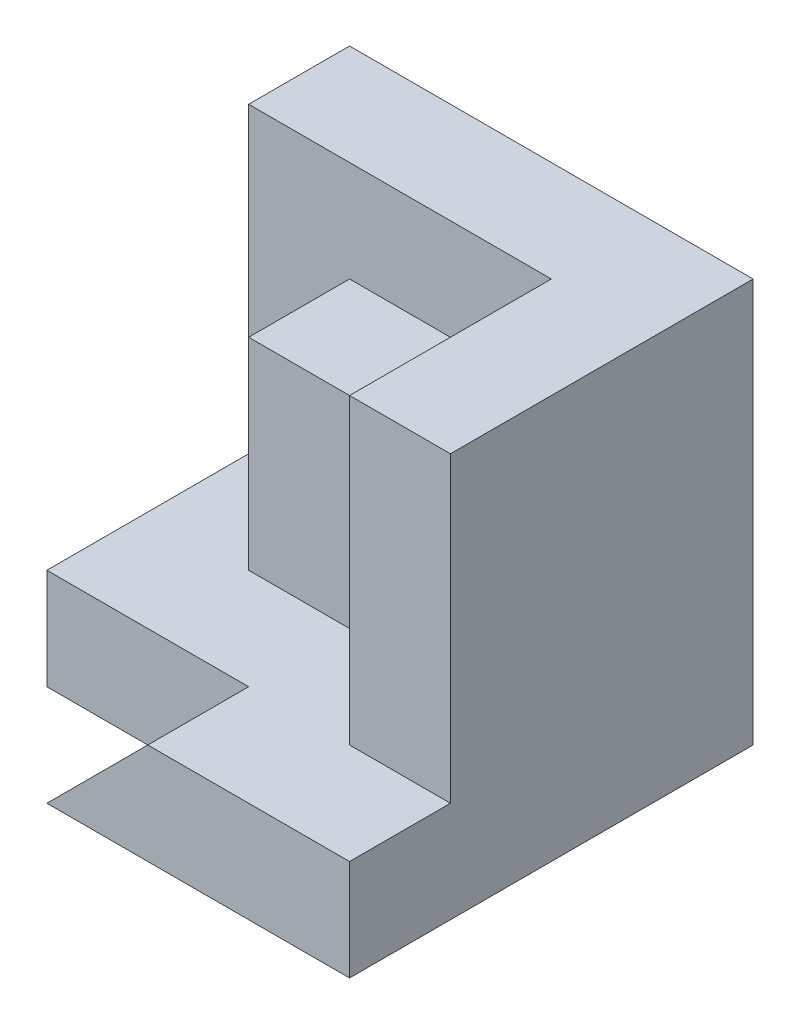
ISO-10303-21;
HEADER;
FILE_DESCRIPTION(('STEP AP214'),'2;1');
FILE_NAME('part.step','',(''),(''),'','','');
FILE_SCHEMA(('AUTOMOTIVE_DESIGN { 1 0 10303 214 1 1 1 1 }'));
ENDSEC;
DATA;
#1=APPLICATION_CONTEXT('core data for automotive mechanical design processes');
#2=APPLICATION_PROTOCOL_DEFINITION('international standard','automotive_design',2000,#1);
#3=PRODUCT_CONTEXT('',#1,'mechanical');
#4=PRODUCT('Part','Part','',(#3));
#5=PRODUCT_RELATED_PRODUCT_CATEGORY('part','',(#4));
#6=PRODUCT_DEFINITION_FORMATION('','',#4);
#7=PRODUCT_DEFINITION_CONTEXT('part definition',#1,'design');
#8=PRODUCT_DEFINITION('design','',#6,#7);
#9=PRODUCT_DEFINITION_SHAPE('','',#8);
#10=(LENGTH_UNIT() NAMED_UNIT(*) SI_UNIT(.MILLI.,.METRE.));
#11=(NAMED_UNIT(*) PLANE_ANGLE_UNIT() SI_UNIT($,.RADIAN.));
#12=(NAMED_UNIT(*) SI_UNIT($,.STERADIAN.) SOLID_ANGLE_UNIT());
#13=UNCERTAINTY_MEASURE_WITH_UNIT(LENGTH_MEASURE(1.E-05),#10,'distance_accuracy_value','');
#14=(GEOMETRIC_REPRESENTATION_CONTEXT(3) GLOBAL_UNCERTAINTY_ASSIGNED_CONTEXT((#13)) GLOBAL_UNIT_ASSIGNED_CONTEXT((#10,
#11,#12)) REPRESENTATION_CONTEXT('',''));
#15=CARTESIAN_POINT('',(0.,0.,0.));
#16=DIRECTION('',(0.,0.,1.));
#17=DIRECTION('',(1.,0.,0.));
#18=AXIS2_PLACEMENT_3D('',#15,#16,#17);
#19=CARTESIAN_POINT('',(0.,0.,30.));
#20=DIRECTION('',(0.,0.,-1.));
#21=DIRECTION('',(-1.,0.,0.));
#22=AXIS2_PLACEMENT_3D('',#19,#20,#21);
#23=PLANE('',#22);
#24=DIRECTION('',(1.,0.,0.));
#25=VECTOR('',#24,1.);
#26=CARTESIAN_POINT('',(0.,10.,30.));
#27=LINE('',#26,#25);
#28=CARTESIAN_POINT('',(0.,10.,30.));
#29=VERTEX_POINT('',#28);
#30=CARTESIAN_POINT('',(20.,10.,30.));
#31=VERTEX_POINT('',#30);
#32=EDGE_CURVE('E48',#29,#31,#27,.T.);
#33=ORIENTED_EDGE('',*,*,#32,.F.);
#34=DIRECTION('',(0.,1.,0.));
#35=VECTOR('',#34,1.);
#36=CARTESIAN_POINT('',(0.,0.,30.));
#37=LINE('',#36,#35);
#38=CARTESIAN_POINT('',(0.,0.,30.));
#39=VERTEX_POINT('',#38);
#40=EDGE_CURVE('E116',#39,#29,#37,.T.);
#41=ORIENTED_EDGE('',*,*,#40,.F.);
#42=DIRECTION('',(-1.,0.,0.));
#43=VECTOR('',#42,1.);
#44=CARTESIAN_POINT('',(0.,0.,30.));
#45=LINE('',#44,#43);
#46=CARTESIAN_POINT('',(10.,0.,30.));
#47=VERTEX_POINT('',#46);
#48=EDGE_CURVE('E235',#47,#39,#45,.T.);
#49=ORIENTED_EDGE('',*,*,#48,.F.);
#50=DIRECTION('',(0.707106781186546,0.707106781186549,0.));
#51=VECTOR('',#50,1.);
#52=CARTESIAN_POINT('',(10.,0.,30.));
#53=LINE('',#52,#51);
#54=EDGE_CURVE('E217',#47,#31,#53,.T.);
#55=ORIENTED_EDGE('',*,*,#54,.T.);
#56=EDGE_LOOP('',(#33,#41,#49,#55));
#57=FACE_BOUND('',#56,.T.);
#58=ADVANCED_FACE('F33',(#57),#23,.F.);
#59=CARTESIAN_POINT('',(0.,0.,40.));
#60=DIRECTION('',(1.,0.,0.));
#61=DIRECTION('',(0.,0.,-1.));
#62=AXIS2_PLACEMENT_3D('',#59,#60,#61);
#63=PLANE('',#62);
#64=DIRECTION('',(0.,0.,1.));
#65=VECTOR('',#64,1.);
#66=CARTESIAN_POINT('',(0.,10.,0.));
#67=LINE('',#66,#65);
#68=CARTESIAN_POINT('',(0.,10.,10.));
#69=VERTEX_POINT('',#68);
#70=EDGE_CURVE('E380',#69,#29,#67,.T.);
#71=ORIENTED_EDGE('',*,*,#70,.F.);
#72=DIRECTION('',(0.,1.,0.));
#73=VECTOR('',#72,1.);
#74=CARTESIAN_POINT('',(0.,10.,10.));
#75=LINE('',#74,#73);
#76=CARTESIAN_POINT('',(0.,40.,10.));
#77=VERTEX_POINT('',#76);
#78=EDGE_CURVE('E207',#69,#77,#75,.T.);
#79=ORIENTED_EDGE('',*,*,#78,.T.);
#80=DIRECTION('',(0.,0.,-1.));
#81=VECTOR('',#80,1.);
#82=CARTESIAN_POINT('',(0.,40.,40.));
#83=LINE('',#82,#81);
#84=CARTESIAN_POINT('',(0.,40.,0.));
#85=VERTEX_POINT('',#84);
#86=EDGE_CURVE('E90',#77,#85,#83,.T.);
#87=ORIENTED_EDGE('',*,*,#86,.T.);
#88=DIRECTION('',(0.,-1.,0.));
#89=VECTOR('',#88,1.);
#90=CARTESIAN_POINT('',(0.,0.,0.));
#91=LINE('',#90,#89);
#92=CARTESIAN_POINT('',(0.,0.,0.));
#93=VERTEX_POINT('',#92);
#94=EDGE_CURVE('E103',#85,#93,#91,.T.);
#95=ORIENTED_EDGE('',*,*,#94,.T.);
#96=DIRECTION('',(0.,0.,-1.));
#97=VECTOR('',#96,1.);
#98=CARTESIAN_POINT('',(0.,0.,40.));
#99=LINE('',#98,#97);
#100=EDGE_CURVE('E11',#39,#93,#99,.T.);
#101=ORIENTED_EDGE('',*,*,#100,.F.);
#102=ORIENTED_EDGE('',*,*,#40,.T.);
#103=EDGE_LOOP('',(#71,#79,#87,#95,#101,#102));
#104=FACE_BOUND('',#103,.T.);
#105=ADVANCED_FACE('F35',(#104),#63,.F.);
#106=CARTESIAN_POINT('',(0.,0.,40.));
#107=DIRECTION('',(0.,1.,0.));
#108=DIRECTION('',(0.,0.,1.));
#109=AXIS2_PLACEMENT_3D('',#106,#107,#108);
#110=PLANE('',#109);
#111=DIRECTION('',(0.,0.,-1.));
#112=VECTOR('',#111,1.);
#113=CARTESIAN_POINT('',(10.,0.,40.));
#114=LINE('',#113,#112);
#115=CARTESIAN_POINT('',(10.,0.,40.));
#116=VERTEX_POINT('',#115);
#117=EDGE_CURVE('E233',#116,#47,#114,.T.);
#118=ORIENTED_EDGE('',*,*,#117,.T.);
#119=ORIENTED_EDGE('',*,*,#48,.T.);
#120=ORIENTED_EDGE('',*,*,#100,.T.);
#121=DIRECTION('',(1.,0.,0.));
#122=VECTOR('',#121,1.);
#123=CARTESIAN_POINT('',(0.,0.,0.));
#124=LINE('',#123,#122);
#125=CARTESIAN_POINT('',(40.,0.,0.));
#126=VERTEX_POINT('',#125);
#127=EDGE_CURVE('E99',#93,#126,#124,.T.);
#128=ORIENTED_EDGE('',*,*,#127,.T.);
#129=DIRECTION('',(0.,0.,-1.));
#130=VECTOR('',#129,1.);
#131=CARTESIAN_POINT('',(40.,0.,40.));
#132=LINE('',#131,#130);
#133=CARTESIAN_POINT('',(40.,0.,40.));
#134=VERTEX_POINT('',#133);
#135=EDGE_CURVE('E41',#134,#126,#132,.T.);
#136=ORIENTED_EDGE('',*,*,#135,.F.);
#137=DIRECTION('',(1.,0.,0.));
#138=VECTOR('',#137,1.);
#139=CARTESIAN_POINT('',(0.,0.,40.));
#140=LINE('',#139,#138);
#141=EDGE_CURVE('E57',#116,#134,#140,.T.);
#142=ORIENTED_EDGE('',*,*,#141,.F.);
#143=EDGE_LOOP('',(#118,#119,#120,#128,#136,#142));
#144=FACE_BOUND('',#143,.T.);
#145=ADVANCED_FACE('F119',(#144),#110,.F.);
#146=CARTESIAN_POINT('',(40.,0.,40.));
#147=DIRECTION('',(-1.,0.,0.));
#148=DIRECTION('',(0.,0.,1.));
#149=AXIS2_PLACEMENT_3D('',#146,#147,#148);
#150=PLANE('',#149);
#151=DIRECTION('',(0.,0.,-1.));
#152=VECTOR('',#151,1.);
#153=CARTESIAN_POINT('',(40.,40.,40.));
#154=LINE('',#153,#152);
#155=CARTESIAN_POINT('',(40.,40.,30.));
#156=VERTEX_POINT('',#155);
#157=CARTESIAN_POINT('',(40.,40.,0.));
#158=VERTEX_POINT('',#157);
#159=EDGE_CURVE('E75',#156,#158,#154,.T.);
#160=ORIENTED_EDGE('',*,*,#159,.F.);
#161=DIRECTION('',(0.,-1.,0.));
#162=VECTOR('',#161,1.);
#163=CARTESIAN_POINT('',(40.,0.,30.));
#164=LINE('',#163,#162);
#165=CARTESIAN_POINT('',(40.,10.,30.));
#166=VERTEX_POINT('',#165);
#167=EDGE_CURVE('E231',#156,#166,#164,.T.);
#168=ORIENTED_EDGE('',*,*,#167,.T.);
#169=DIRECTION('',(0.,0.,1.));
#170=VECTOR('',#169,1.);
#171=CARTESIAN_POINT('',(40.,10.,40.));
#172=LINE('',#171,#170);
#173=CARTESIAN_POINT('',(40.,10.,40.));
#174=VERTEX_POINT('',#173);
#175=EDGE_CURVE('E226',#166,#174,#172,.T.);
#176=ORIENTED_EDGE('',*,*,#175,.T.);
#177=DIRECTION('',(0.,1.,0.));
#178=VECTOR('',#177,1.);
#179=CARTESIAN_POINT('',(40.,0.,40.));
#180=LINE('',#179,#178);
#181=EDGE_CURVE('E105',#134,#174,#180,.T.);
#182=ORIENTED_EDGE('',*,*,#181,.F.);
#183=ORIENTED_EDGE('',*,*,#135,.T.);
#184=DIRECTION('',(0.,1.,0.));
#185=VECTOR('',#184,1.);
#186=CARTESIAN_POINT('',(40.,0.,0.));
#187=LINE('',#186,#185);
#188=EDGE_CURVE('E94',#126,#158,#187,.T.);
#189=ORIENTED_EDGE('',*,*,#188,.T.);
#190=EDGE_LOOP('',(#160,#168,#176,#182,#183,#189));
#191=FACE_BOUND('',#190,.T.);
#192=ADVANCED_FACE('F95',(#191),#150,.F.);
#193=CARTESIAN_POINT('',(0.,40.,40.));
#194=DIRECTION('',(0.,-1.,0.));
#195=DIRECTION('',(0.,0.,-1.));
#196=AXIS2_PLACEMENT_3D('',#193,#194,#195);
#197=PLANE('',#196);
#198=DIRECTION('',(-1.,0.,0.));
#199=VECTOR('',#198,1.);
#200=CARTESIAN_POINT('',(0.,40.,10.));
#201=LINE('',#200,#199);
#202=CARTESIAN_POINT('',(30.,40.,10.));
#203=VERTEX_POINT('',#202);
#204=EDGE_CURVE('E371',#203,#77,#201,.T.);
#205=ORIENTED_EDGE('',*,*,#204,.F.);
#206=DIRECTION('',(0.,0.,-1.));
#207=VECTOR('',#206,1.);
#208=CARTESIAN_POINT('',(30.,40.,0.));
#209=LINE('',#208,#207);
#210=CARTESIAN_POINT('',(30.,40.,30.));
#211=VERTEX_POINT('',#210);
#212=EDGE_CURVE('E369',#211,#203,#209,.T.);
#213=ORIENTED_EDGE('',*,*,#212,.F.);
#214=DIRECTION('',(-1.,0.,0.));
#215=VECTOR('',#214,1.);
#216=CARTESIAN_POINT('',(0.,40.,30.));
#217=LINE('',#216,#215);
#218=EDGE_CURVE('E86',#156,#211,#217,.T.);
#219=ORIENTED_EDGE('',*,*,#218,.F.);
#220=ORIENTED_EDGE('',*,*,#159,.T.);
#221=DIRECTION('',(-1.,0.,0.));
#222=VECTOR('',#221,1.);
#223=CARTESIAN_POINT('',(0.,40.,0.));
#224=LINE('',#223,#222);
#225=EDGE_CURVE('E81',#158,#85,#224,.T.);
#226=ORIENTED_EDGE('',*,*,#225,.T.);
#227=ORIENTED_EDGE('',*,*,#86,.F.);
#228=EDGE_LOOP('',(#205,#213,#219,#220,#226,#227));
#229=FACE_BOUND('',#228,.T.);
#230=ADVANCED_FACE('F78',(#229),#197,.F.);
#231=CARTESIAN_POINT('',(0.,0.,40.));
#232=DIRECTION('',(0.,0.,-1.));
#233=DIRECTION('',(-1.,0.,0.));
#234=AXIS2_PLACEMENT_3D('',#231,#232,#233);
#235=PLANE('',#234);
#236=DIRECTION('',(-1.,0.,0.));
#237=VECTOR('',#236,1.);
#238=CARTESIAN_POINT('',(50.,10.,40.));
#239=LINE('',#238,#237);
#240=CARTESIAN_POINT('',(20.,10.,40.));
#241=VERTEX_POINT('',#240);
#242=EDGE_CURVE('E224',#174,#241,#239,.T.);
#243=ORIENTED_EDGE('',*,*,#242,.T.);
#244=DIRECTION('',(0.707106781186546,0.707106781186549,0.));
#245=VECTOR('',#244,1.);
#246=CARTESIAN_POINT('',(10.,0.,40.));
#247=LINE('',#246,#245);
#248=EDGE_CURVE('E220',#116,#241,#247,.T.);
#249=ORIENTED_EDGE('',*,*,#248,.F.);
#250=ORIENTED_EDGE('',*,*,#141,.T.);
#251=ORIENTED_EDGE('',*,*,#181,.T.);
#252=EDGE_LOOP('',(#243,#249,#250,#251));
#253=FACE_BOUND('',#252,.T.);
#254=ADVANCED_FACE('F244',(#253),#235,.F.);
#255=CARTESIAN_POINT('',(0.,0.,0.));
#256=DIRECTION('',(0.,0.,-1.));
#257=DIRECTION('',(-1.,0.,0.));
#258=AXIS2_PLACEMENT_3D('',#255,#256,#257);
#259=PLANE('',#258);
#260=ORIENTED_EDGE('',*,*,#94,.F.);
#261=ORIENTED_EDGE('',*,*,#225,.F.);
#262=ORIENTED_EDGE('',*,*,#188,.F.);
#263=ORIENTED_EDGE('',*,*,#127,.F.);
#264=EDGE_LOOP('',(#260,#261,#262,#263));
#265=FACE_BOUND('',#264,.T.);
#266=ADVANCED_FACE('F101',(#265),#259,.T.);
#267=ORIENTED_EDGE('',*,*,#218,.T.);
#268=DIRECTION('',(0.,1.,0.));
#269=VECTOR('',#268,1.);
#270=CARTESIAN_POINT('',(30.,10.,30.));
#271=LINE('',#270,#269);
#272=CARTESIAN_POINT('',(30.,10.,30.));
#273=VERTEX_POINT('',#272);
#274=EDGE_CURVE('E210',#273,#211,#271,.T.);
#275=ORIENTED_EDGE('',*,*,#274,.F.);
#276=DIRECTION('',(-1.,0.,0.));
#277=VECTOR('',#276,1.);
#278=CARTESIAN_POINT('',(50.,10.,30.));
#279=LINE('',#278,#277);
#280=EDGE_CURVE('E223',#166,#273,#279,.T.);
#281=ORIENTED_EDGE('',*,*,#280,.F.);
#282=ORIENTED_EDGE('',*,*,#167,.F.);
#283=EDGE_LOOP('',(#267,#275,#281,#282));
#284=FACE_BOUND('',#283,.T.);
#285=ADVANCED_FACE('F239',(#284),#23,.F.);
#286=CARTESIAN_POINT('',(50.,10.,0.));
#287=DIRECTION('',(0.,-1.,0.));
#288=DIRECTION('',(0.,0.,-1.));
#289=AXIS2_PLACEMENT_3D('',#286,#287,#288);
#290=PLANE('',#289);
#291=ORIENTED_EDGE('',*,*,#280,.T.);
#292=DIRECTION('',(0.,0.,-1.));
#293=VECTOR('',#292,1.);
#294=CARTESIAN_POINT('',(30.,10.,0.));
#295=LINE('',#294,#293);
#296=CARTESIAN_POINT('',(30.,10.,20.));
#297=VERTEX_POINT('',#296);
#298=EDGE_CURVE('E213',#273,#297,#295,.T.);
#299=ORIENTED_EDGE('',*,*,#298,.T.);
#300=DIRECTION('',(-1.,0.,0.));
#301=VECTOR('',#300,1.);
#302=CARTESIAN_POINT('',(0.,10.,20.));
#303=LINE('',#302,#301);
#304=CARTESIAN_POINT('',(10.,10.,20.));
#305=VERTEX_POINT('',#304);
#306=EDGE_CURVE('E208',#297,#305,#303,.T.);
#307=ORIENTED_EDGE('',*,*,#306,.T.);
#308=DIRECTION('',(0.,0.,-1.));
#309=VECTOR('',#308,1.);
#310=CARTESIAN_POINT('',(10.,10.,0.));
#311=LINE('',#310,#309);
#312=CARTESIAN_POINT('',(10.,10.,10.));
#313=VERTEX_POINT('',#312);
#314=EDGE_CURVE('E370',#305,#313,#311,.T.);
#315=ORIENTED_EDGE('',*,*,#314,.T.);
#316=DIRECTION('',(-1.,0.,0.));
#317=VECTOR('',#316,1.);
#318=CARTESIAN_POINT('',(0.,10.,10.));
#319=LINE('',#318,#317);
#320=EDGE_CURVE('E205',#313,#69,#319,.T.);
#321=ORIENTED_EDGE('',*,*,#320,.T.);
#322=ORIENTED_EDGE('',*,*,#70,.T.);
#323=ORIENTED_EDGE('',*,*,#32,.T.);
#324=DIRECTION('',(0.,0.,1.));
#325=VECTOR('',#324,1.);
#326=CARTESIAN_POINT('',(20.,10.,30.));
#327=LINE('',#326,#325);
#328=EDGE_CURVE('E219',#31,#241,#327,.T.);
#329=ORIENTED_EDGE('',*,*,#328,.T.);
#330=ORIENTED_EDGE('',*,*,#242,.F.);
#331=ORIENTED_EDGE('',*,*,#175,.F.);
#332=EDGE_LOOP('',(#291,#299,#307,#315,#321,#322,#323,#329,#330,#331));
#333=FACE_BOUND('',#332,.T.);
#334=ADVANCED_FACE('F241',(#333),#290,.F.);
#335=CARTESIAN_POINT('',(10.,0.,30.));
#336=DIRECTION('',(0.707106781186549,-0.707106781186546,0.));
#337=DIRECTION('',(0.707106781186546,0.707106781186549,0.));
#338=AXIS2_PLACEMENT_3D('',#335,#336,#337);
#339=PLANE('',#338);
#340=ORIENTED_EDGE('',*,*,#248,.T.);
#341=ORIENTED_EDGE('',*,*,#328,.F.);
#342=ORIENTED_EDGE('',*,*,#54,.F.);
#343=ORIENTED_EDGE('',*,*,#117,.F.);
#344=EDGE_LOOP('',(#340,#341,#342,#343));
#345=FACE_BOUND('',#344,.T.);
#346=ADVANCED_FACE('F246',(#345),#339,.F.);
#347=CARTESIAN_POINT('',(10.,10.,0.));
#348=DIRECTION('',(1.,0.,0.));
#349=DIRECTION('',(0.,0.,-1.));
#350=AXIS2_PLACEMENT_3D('',#347,#348,#349);
#351=PLANE('',#350);
#352=DIRECTION('',(0.,1.,0.));
#353=VECTOR('',#352,1.);
#354=CARTESIAN_POINT('',(10.,10.,20.));
#355=LINE('',#354,#353);
#356=CARTESIAN_POINT('',(10.,30.,20.));
#357=VERTEX_POINT('',#356);
#358=EDGE_CURVE('E201',#305,#357,#355,.T.);
#359=ORIENTED_EDGE('',*,*,#358,.T.);
#360=DIRECTION('',(0.,0.,1.));
#361=VECTOR('',#360,1.);
#362=CARTESIAN_POINT('',(10.,30.,10.));
#363=LINE('',#362,#361);
#364=CARTESIAN_POINT('',(10.,30.,10.));
#365=VERTEX_POINT('',#364);
#366=EDGE_CURVE('E185',#365,#357,#363,.T.);
#367=ORIENTED_EDGE('',*,*,#366,.F.);
#368=DIRECTION('',(0.,1.,0.));
#369=VECTOR('',#368,1.);
#370=CARTESIAN_POINT('',(10.,10.,10.));
#371=LINE('',#370,#369);
#372=EDGE_CURVE('E199',#313,#365,#371,.T.);
#373=ORIENTED_EDGE('',*,*,#372,.F.);
#374=ORIENTED_EDGE('',*,*,#314,.F.);
#375=EDGE_LOOP('',(#359,#367,#373,#374));
#376=FACE_BOUND('',#375,.T.);
#377=ADVANCED_FACE('F197',(#376),#351,.F.);
#378=CARTESIAN_POINT('',(0.,10.,20.));
#379=DIRECTION('',(0.,0.,-1.));
#380=DIRECTION('',(-1.,0.,0.));
#381=AXIS2_PLACEMENT_3D('',#378,#379,#380);
#382=PLANE('',#381);
#383=DIRECTION('',(0.,1.,0.));
#384=VECTOR('',#383,1.);
#385=CARTESIAN_POINT('',(30.,10.,20.));
#386=LINE('',#385,#384);
#387=CARTESIAN_POINT('',(30.,30.,20.));
#388=VERTEX_POINT('',#387);
#389=EDGE_CURVE('E385',#297,#388,#386,.T.);
#390=ORIENTED_EDGE('',*,*,#389,.T.);
#391=DIRECTION('',(1.,0.,0.));
#392=VECTOR('',#391,1.);
#393=CARTESIAN_POINT('',(10.,30.,20.));
#394=LINE('',#393,#392);
#395=EDGE_CURVE('E193',#357,#388,#394,.T.);
#396=ORIENTED_EDGE('',*,*,#395,.F.);
#397=ORIENTED_EDGE('',*,*,#358,.F.);
#398=ORIENTED_EDGE('',*,*,#306,.F.);
#399=EDGE_LOOP('',(#390,#396,#397,#398));
#400=FACE_BOUND('',#399,.T.);
#401=ADVANCED_FACE('F324',(#400),#382,.F.);
#402=CARTESIAN_POINT('',(30.,10.,0.));
#403=DIRECTION('',(1.,0.,0.));
#404=DIRECTION('',(0.,0.,-1.));
#405=AXIS2_PLACEMENT_3D('',#402,#403,#404);
#406=PLANE('',#405);
#407=ORIENTED_EDGE('',*,*,#212,.T.);
#408=DIRECTION('',(0.,1.,0.));
#409=VECTOR('',#408,1.);
#410=CARTESIAN_POINT('',(30.,40.,10.));
#411=LINE('',#410,#409);
#412=CARTESIAN_POINT('',(30.,30.,10.));
#413=VERTEX_POINT('',#412);
#414=EDGE_CURVE('E192',#413,#203,#411,.T.);
#415=ORIENTED_EDGE('',*,*,#414,.F.);
#416=DIRECTION('',(0.,0.,1.));
#417=VECTOR('',#416,1.);
#418=CARTESIAN_POINT('',(30.,30.,10.));
#419=LINE('',#418,#417);
#420=EDGE_CURVE('E187',#413,#388,#419,.T.);
#421=ORIENTED_EDGE('',*,*,#420,.T.);
#422=ORIENTED_EDGE('',*,*,#389,.F.);
#423=ORIENTED_EDGE('',*,*,#298,.F.);
#424=ORIENTED_EDGE('',*,*,#274,.T.);
#425=EDGE_LOOP('',(#407,#415,#421,#422,#423,#424));
#426=FACE_BOUND('',#425,.T.);
#427=ADVANCED_FACE('F330',(#426),#406,.F.);
#428=CARTESIAN_POINT('',(0.,10.,10.));
#429=DIRECTION('',(0.,0.,-1.));
#430=DIRECTION('',(-1.,0.,0.));
#431=AXIS2_PLACEMENT_3D('',#428,#429,#430);
#432=PLANE('',#431);
#433=ORIENTED_EDGE('',*,*,#204,.T.);
#434=ORIENTED_EDGE('',*,*,#78,.F.);
#435=ORIENTED_EDGE('',*,*,#320,.F.);
#436=ORIENTED_EDGE('',*,*,#372,.T.);
#437=DIRECTION('',(1.,0.,0.));
#438=VECTOR('',#437,1.);
#439=CARTESIAN_POINT('',(10.,30.,10.));
#440=LINE('',#439,#438);
#441=EDGE_CURVE('E181',#365,#413,#440,.T.);
#442=ORIENTED_EDGE('',*,*,#441,.T.);
#443=ORIENTED_EDGE('',*,*,#414,.T.);
#444=EDGE_LOOP('',(#433,#434,#435,#436,#442,#443));
#445=FACE_BOUND('',#444,.T.);
#446=ADVANCED_FACE('F203',(#445),#432,.F.);
#447=CARTESIAN_POINT('',(10.,30.,10.));
#448=DIRECTION('',(0.,-1.,0.));
#449=DIRECTION('',(0.,0.,-1.));
#450=AXIS2_PLACEMENT_3D('',#447,#448,#449);
#451=PLANE('',#450);
#452=ORIENTED_EDGE('',*,*,#395,.T.);
#453=ORIENTED_EDGE('',*,*,#420,.F.);
#454=ORIENTED_EDGE('',*,*,#441,.F.);
#455=ORIENTED_EDGE('',*,*,#366,.T.);
#456=EDGE_LOOP('',(#452,#453,#454,#455));
#457=FACE_BOUND('',#456,.T.);
#458=ADVANCED_FACE('F184',(#457),#451,.F.);
#459=CLOSED_SHELL('',(#58,#105,#145,#192,#230,#254,#266,#285,#334,#346,#377,#401,#427,#446,#458));
#460=MANIFOLD_SOLID_BREP('B2',#459);
#461=ADVANCED_BREP_SHAPE_REPRESENTATION('',(#18,#460),#14);
#462=SHAPE_DEFINITION_REPRESENTATION(#9,#461);
ENDSEC;
END-ISO-10303-21;
